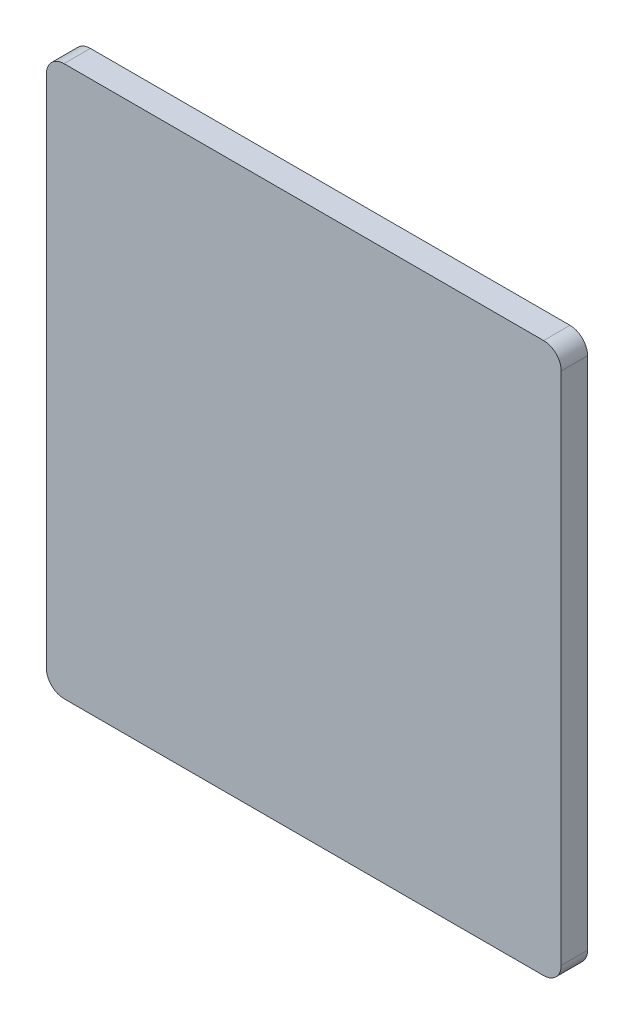
ISO-10303-21;
HEADER;
FILE_DESCRIPTION(('STEP AP214'),'2;1');
FILE_NAME('part.step','',(''),(''),'','','');
FILE_SCHEMA(('AUTOMOTIVE_DESIGN { 1 0 10303 214 1 1 1 1 }'));
ENDSEC;
DATA;
#1=APPLICATION_CONTEXT('core data for automotive mechanical design processes');
#2=APPLICATION_PROTOCOL_DEFINITION('international standard','automotive_design',2000,#1);
#3=PRODUCT_CONTEXT('',#1,'mechanical');
#4=PRODUCT('Part','Part','',(#3));
#5=PRODUCT_RELATED_PRODUCT_CATEGORY('part','',(#4));
#6=PRODUCT_DEFINITION_FORMATION('','',#4);
#7=PRODUCT_DEFINITION_CONTEXT('part definition',#1,'design');
#8=PRODUCT_DEFINITION('design','',#6,#7);
#9=PRODUCT_DEFINITION_SHAPE('','',#8);
#10=(LENGTH_UNIT() NAMED_UNIT(*) SI_UNIT(.MILLI.,.METRE.));
#11=(NAMED_UNIT(*) PLANE_ANGLE_UNIT() SI_UNIT($,.RADIAN.));
#12=(NAMED_UNIT(*) SI_UNIT($,.STERADIAN.) SOLID_ANGLE_UNIT());
#13=UNCERTAINTY_MEASURE_WITH_UNIT(LENGTH_MEASURE(1.E-05),#10,'distance_accuracy_value','');
#14=(GEOMETRIC_REPRESENTATION_CONTEXT(3) GLOBAL_UNCERTAINTY_ASSIGNED_CONTEXT((#13)) GLOBAL_UNIT_ASSIGNED_CONTEXT((#10,
#11,#12)) REPRESENTATION_CONTEXT('',''));
#15=CARTESIAN_POINT('',(0.,0.,0.));
#16=DIRECTION('',(0.,0.,1.));
#17=DIRECTION('',(1.,0.,0.));
#18=AXIS2_PLACEMENT_3D('',#15,#16,#17);
#19=CARTESIAN_POINT('',(2.,2.,3.));
#20=DIRECTION('',(0.,0.,-1.));
#21=DIRECTION('',(-1.,0.,0.));
#22=AXIS2_PLACEMENT_3D('',#19,#20,#21);
#23=CYLINDRICAL_SURFACE('',#22,2.);
#24=CARTESIAN_POINT('',(2.,2.,0.));
#25=DIRECTION('',(0.,0.,1.));
#26=DIRECTION('',(-1.,0.,0.));
#27=AXIS2_PLACEMENT_3D('',#24,#25,#26);
#28=CIRCLE('',#27,2.);
#29=CARTESIAN_POINT('',(0.,2.00000000000001,0.));
#30=VERTEX_POINT('',#29);
#31=CARTESIAN_POINT('',(2.00000000000001,0.,0.));
#32=VERTEX_POINT('',#31);
#33=EDGE_CURVE('E131',#30,#32,#28,.T.);
#34=ORIENTED_EDGE('',*,*,#33,.T.);
#35=DIRECTION('',(0.,0.,-1.));
#36=VECTOR('',#35,1.);
#37=CARTESIAN_POINT('',(2.00000000000001,0.,3.));
#38=LINE('',#37,#36);
#39=CARTESIAN_POINT('',(2.00000000000001,0.,3.));
#40=VERTEX_POINT('',#39);
#41=EDGE_CURVE('E11',#40,#32,#38,.T.);
#42=ORIENTED_EDGE('',*,*,#41,.F.);
#43=CARTESIAN_POINT('',(2.,2.,3.));
#44=DIRECTION('',(0.,0.,1.));
#45=DIRECTION('',(-1.,0.,0.));
#46=AXIS2_PLACEMENT_3D('',#43,#44,#45);
#47=CIRCLE('',#46,2.);
#48=CARTESIAN_POINT('',(0.,2.00000000000001,3.));
#49=VERTEX_POINT('',#48);
#50=EDGE_CURVE('E145',#49,#40,#47,.T.);
#51=ORIENTED_EDGE('',*,*,#50,.F.);
#52=DIRECTION('',(0.,0.,-1.));
#53=VECTOR('',#52,1.);
#54=CARTESIAN_POINT('',(0.,2.00000000000001,3.));
#55=LINE('',#54,#53);
#56=EDGE_CURVE('E127',#49,#30,#55,.T.);
#57=ORIENTED_EDGE('',*,*,#56,.T.);
#58=EDGE_LOOP('',(#34,#42,#51,#57));
#59=FACE_BOUND('',#58,.T.);
#60=ADVANCED_FACE('F35',(#59),#23,.T.);
#61=CARTESIAN_POINT('',(2.00000000000001,0.,3.));
#62=DIRECTION('',(0.,1.,0.));
#63=DIRECTION('',(0.,0.,1.));
#64=AXIS2_PLACEMENT_3D('',#61,#62,#63);
#65=PLANE('',#64);
#66=DIRECTION('',(1.,0.,0.));
#67=VECTOR('',#66,1.);
#68=CARTESIAN_POINT('',(2.00000000000001,0.,0.));
#69=LINE('',#68,#67);
#70=CARTESIAN_POINT('',(56.5,0.,0.));
#71=VERTEX_POINT('',#70);
#72=EDGE_CURVE('E134',#32,#71,#69,.T.);
#73=ORIENTED_EDGE('',*,*,#72,.T.);
#74=DIRECTION('',(0.,0.,-1.));
#75=VECTOR('',#74,1.);
#76=CARTESIAN_POINT('',(56.5,0.,3.));
#77=LINE('',#76,#75);
#78=CARTESIAN_POINT('',(56.5,0.,3.));
#79=VERTEX_POINT('',#78);
#80=EDGE_CURVE('E43',#79,#71,#77,.T.);
#81=ORIENTED_EDGE('',*,*,#80,.F.);
#82=DIRECTION('',(1.,0.,0.));
#83=VECTOR('',#82,1.);
#84=CARTESIAN_POINT('',(2.00000000000001,0.,3.));
#85=LINE('',#84,#83);
#86=EDGE_CURVE('E94',#40,#79,#85,.T.);
#87=ORIENTED_EDGE('',*,*,#86,.F.);
#88=ORIENTED_EDGE('',*,*,#41,.T.);
#89=EDGE_LOOP('',(#73,#81,#87,#88));
#90=FACE_BOUND('',#89,.T.);
#91=ADVANCED_FACE('F180',(#90),#65,.F.);
#92=CARTESIAN_POINT('',(56.5,2.,3.));
#93=DIRECTION('',(0.,0.,-1.));
#94=DIRECTION('',(-1.,0.,0.));
#95=AXIS2_PLACEMENT_3D('',#92,#93,#94);
#96=CYLINDRICAL_SURFACE('',#95,2.);
#97=CARTESIAN_POINT('',(56.5,2.,0.));
#98=DIRECTION('',(0.,0.,1.));
#99=DIRECTION('',(1.,0.,0.));
#100=AXIS2_PLACEMENT_3D('',#97,#98,#99);
#101=CIRCLE('',#100,2.);
#102=CARTESIAN_POINT('',(58.5,2.,0.));
#103=VERTEX_POINT('',#102);
#104=EDGE_CURVE('E136',#71,#103,#101,.T.);
#105=ORIENTED_EDGE('',*,*,#104,.T.);
#106=DIRECTION('',(0.,0.,-1.));
#107=VECTOR('',#106,1.);
#108=CARTESIAN_POINT('',(58.5,2.,3.));
#109=LINE('',#108,#107);
#110=CARTESIAN_POINT('',(58.5,2.,3.));
#111=VERTEX_POINT('',#110);
#112=EDGE_CURVE('E152',#111,#103,#109,.T.);
#113=ORIENTED_EDGE('',*,*,#112,.F.);
#114=CARTESIAN_POINT('',(56.5,2.,3.));
#115=DIRECTION('',(0.,0.,1.));
#116=DIRECTION('',(1.,0.,0.));
#117=AXIS2_PLACEMENT_3D('',#114,#115,#116);
#118=CIRCLE('',#117,2.);
#119=EDGE_CURVE('E160',#79,#111,#118,.T.);
#120=ORIENTED_EDGE('',*,*,#119,.F.);
#121=ORIENTED_EDGE('',*,*,#80,.T.);
#122=EDGE_LOOP('',(#105,#113,#120,#121));
#123=FACE_BOUND('',#122,.T.);
#124=ADVANCED_FACE('F158',(#123),#96,.T.);
#125=CARTESIAN_POINT('',(58.5,2.00000000000001,3.));
#126=DIRECTION('',(-1.,0.,0.));
#127=DIRECTION('',(0.,-1.,0.));
#128=AXIS2_PLACEMENT_3D('',#125,#126,#127);
#129=PLANE('',#128);
#130=DIRECTION('',(0.,1.,0.));
#131=VECTOR('',#130,1.);
#132=CARTESIAN_POINT('',(58.5,2.00000000000001,0.));
#133=LINE('',#132,#131);
#134=CARTESIAN_POINT('',(58.5,60.5,0.));
#135=VERTEX_POINT('',#134);
#136=EDGE_CURVE('E138',#103,#135,#133,.T.);
#137=ORIENTED_EDGE('',*,*,#136,.T.);
#138=DIRECTION('',(0.,0.,-1.));
#139=VECTOR('',#138,1.);
#140=CARTESIAN_POINT('',(58.5,60.5,3.));
#141=LINE('',#140,#139);
#142=CARTESIAN_POINT('',(58.5,60.5,3.));
#143=VERTEX_POINT('',#142);
#144=EDGE_CURVE('E149',#143,#135,#141,.T.);
#145=ORIENTED_EDGE('',*,*,#144,.F.);
#146=DIRECTION('',(0.,1.,0.));
#147=VECTOR('',#146,1.);
#148=CARTESIAN_POINT('',(58.5,2.00000000000001,3.));
#149=LINE('',#148,#147);
#150=EDGE_CURVE('E172',#111,#143,#149,.T.);
#151=ORIENTED_EDGE('',*,*,#150,.F.);
#152=ORIENTED_EDGE('',*,*,#112,.T.);
#153=EDGE_LOOP('',(#137,#145,#151,#152));
#154=FACE_BOUND('',#153,.T.);
#155=ADVANCED_FACE('F168',(#154),#129,.F.);
#156=CARTESIAN_POINT('',(56.5,60.5,3.));
#157=DIRECTION('',(0.,0.,-1.));
#158=DIRECTION('',(-1.,0.,0.));
#159=AXIS2_PLACEMENT_3D('',#156,#157,#158);
#160=CYLINDRICAL_SURFACE('',#159,2.);
#161=CARTESIAN_POINT('',(56.5,60.5,0.));
#162=DIRECTION('',(0.,0.,1.));
#163=DIRECTION('',(-1.,0.,0.));
#164=AXIS2_PLACEMENT_3D('',#161,#162,#163);
#165=CIRCLE('',#164,2.);
#166=CARTESIAN_POINT('',(56.5,62.5,0.));
#167=VERTEX_POINT('',#166);
#168=EDGE_CURVE('E140',#135,#167,#165,.T.);
#169=ORIENTED_EDGE('',*,*,#168,.T.);
#170=DIRECTION('',(0.,0.,-1.));
#171=VECTOR('',#170,1.);
#172=CARTESIAN_POINT('',(56.5,62.5,3.));
#173=LINE('',#172,#171);
#174=CARTESIAN_POINT('',(56.5,62.5,3.));
#175=VERTEX_POINT('',#174);
#176=EDGE_CURVE('E122',#175,#167,#173,.T.);
#177=ORIENTED_EDGE('',*,*,#176,.F.);
#178=CARTESIAN_POINT('',(56.5,60.5,3.));
#179=DIRECTION('',(0.,0.,1.));
#180=DIRECTION('',(-1.,0.,0.));
#181=AXIS2_PLACEMENT_3D('',#178,#179,#180);
#182=CIRCLE('',#181,2.);
#183=EDGE_CURVE('E113',#143,#175,#182,.T.);
#184=ORIENTED_EDGE('',*,*,#183,.F.);
#185=ORIENTED_EDGE('',*,*,#144,.T.);
#186=EDGE_LOOP('',(#169,#177,#184,#185));
#187=FACE_BOUND('',#186,.T.);
#188=ADVANCED_FACE('F171',(#187),#160,.T.);
#189=CARTESIAN_POINT('',(2.00000000000001,62.5,3.));
#190=DIRECTION('',(0.,-1.,0.));
#191=DIRECTION('',(0.,0.,-1.));
#192=AXIS2_PLACEMENT_3D('',#189,#190,#191);
#193=PLANE('',#192);
#194=DIRECTION('',(-1.,0.,0.));
#195=VECTOR('',#194,1.);
#196=CARTESIAN_POINT('',(2.00000000000001,62.5,0.));
#197=LINE('',#196,#195);
#198=CARTESIAN_POINT('',(2.00000000000001,62.5,0.));
#199=VERTEX_POINT('',#198);
#200=EDGE_CURVE('E121',#167,#199,#197,.T.);
#201=ORIENTED_EDGE('',*,*,#200,.T.);
#202=DIRECTION('',(0.,0.,-1.));
#203=VECTOR('',#202,1.);
#204=CARTESIAN_POINT('',(2.00000000000001,62.5,3.));
#205=LINE('',#204,#203);
#206=CARTESIAN_POINT('',(2.00000000000001,62.5,3.));
#207=VERTEX_POINT('',#206);
#208=EDGE_CURVE('E118',#207,#199,#205,.T.);
#209=ORIENTED_EDGE('',*,*,#208,.F.);
#210=DIRECTION('',(-1.,0.,0.));
#211=VECTOR('',#210,1.);
#212=CARTESIAN_POINT('',(2.00000000000001,62.5,3.));
#213=LINE('',#212,#211);
#214=EDGE_CURVE('E107',#175,#207,#213,.T.);
#215=ORIENTED_EDGE('',*,*,#214,.F.);
#216=ORIENTED_EDGE('',*,*,#176,.T.);
#217=EDGE_LOOP('',(#201,#209,#215,#216));
#218=FACE_BOUND('',#217,.T.);
#219=ADVANCED_FACE('F119',(#218),#193,.F.);
#220=CARTESIAN_POINT('',(1.99999999999999,60.5,3.));
#221=DIRECTION('',(0.,0.,-1.));
#222=DIRECTION('',(-1.,0.,0.));
#223=AXIS2_PLACEMENT_3D('',#220,#221,#222);
#224=CYLINDRICAL_SURFACE('',#223,2.);
#225=CARTESIAN_POINT('',(1.99999999999999,60.5,0.));
#226=DIRECTION('',(0.,0.,1.));
#227=DIRECTION('',(-1.,0.,0.));
#228=AXIS2_PLACEMENT_3D('',#225,#226,#227);
#229=CIRCLE('',#228,2.);
#230=CARTESIAN_POINT('',(0.,60.5,0.));
#231=VERTEX_POINT('',#230);
#232=EDGE_CURVE('E80',#199,#231,#229,.T.);
#233=ORIENTED_EDGE('',*,*,#232,.T.);
#234=DIRECTION('',(0.,0.,-1.));
#235=VECTOR('',#234,1.);
#236=CARTESIAN_POINT('',(0.,60.5,3.));
#237=LINE('',#236,#235);
#238=CARTESIAN_POINT('',(0.,60.5,3.));
#239=VERTEX_POINT('',#238);
#240=EDGE_CURVE('E123',#239,#231,#237,.T.);
#241=ORIENTED_EDGE('',*,*,#240,.F.);
#242=CARTESIAN_POINT('',(1.99999999999999,60.5,3.));
#243=DIRECTION('',(0.,0.,1.));
#244=DIRECTION('',(-1.,0.,0.));
#245=AXIS2_PLACEMENT_3D('',#242,#243,#244);
#246=CIRCLE('',#245,2.);
#247=EDGE_CURVE('E111',#207,#239,#246,.T.);
#248=ORIENTED_EDGE('',*,*,#247,.F.);
#249=ORIENTED_EDGE('',*,*,#208,.T.);
#250=EDGE_LOOP('',(#233,#241,#248,#249));
#251=FACE_BOUND('',#250,.T.);
#252=ADVANCED_FACE('F125',(#251),#224,.T.);
#253=CARTESIAN_POINT('',(0.,2.00000000000001,3.));
#254=DIRECTION('',(1.,0.,0.));
#255=DIRECTION('',(0.,1.,0.));
#256=AXIS2_PLACEMENT_3D('',#253,#254,#255);
#257=PLANE('',#256);
#258=DIRECTION('',(0.,-1.,0.));
#259=VECTOR('',#258,1.);
#260=CARTESIAN_POINT('',(0.,2.00000000000001,0.));
#261=LINE('',#260,#259);
#262=EDGE_CURVE('E86',#231,#30,#261,.T.);
#263=ORIENTED_EDGE('',*,*,#262,.T.);
#264=ORIENTED_EDGE('',*,*,#56,.F.);
#265=DIRECTION('',(0.,-1.,0.));
#266=VECTOR('',#265,1.);
#267=CARTESIAN_POINT('',(0.,2.00000000000001,3.));
#268=LINE('',#267,#266);
#269=EDGE_CURVE('E51',#239,#49,#268,.T.);
#270=ORIENTED_EDGE('',*,*,#269,.F.);
#271=ORIENTED_EDGE('',*,*,#240,.T.);
#272=EDGE_LOOP('',(#263,#264,#270,#271));
#273=FACE_BOUND('',#272,.T.);
#274=ADVANCED_FACE('F196',(#273),#257,.F.);
#275=CARTESIAN_POINT('',(2.,2.,3.));
#276=DIRECTION('',(0.,0.,-1.));
#277=DIRECTION('',(-1.,0.,0.));
#278=AXIS2_PLACEMENT_3D('',#275,#276,#277);
#279=PLANE('',#278);
#280=ORIENTED_EDGE('',*,*,#50,.T.);
#281=ORIENTED_EDGE('',*,*,#86,.T.);
#282=ORIENTED_EDGE('',*,*,#119,.T.);
#283=ORIENTED_EDGE('',*,*,#150,.T.);
#284=ORIENTED_EDGE('',*,*,#183,.T.);
#285=ORIENTED_EDGE('',*,*,#214,.T.);
#286=ORIENTED_EDGE('',*,*,#247,.T.);
#287=ORIENTED_EDGE('',*,*,#269,.T.);
#288=EDGE_LOOP('',(#280,#281,#282,#283,#284,#285,#286,#287));
#289=FACE_BOUND('',#288,.T.);
#290=ADVANCED_FACE('F109',(#289),#279,.F.);
#291=CARTESIAN_POINT('',(2.,2.,0.));
#292=DIRECTION('',(0.,0.,-1.));
#293=DIRECTION('',(-1.,0.,0.));
#294=AXIS2_PLACEMENT_3D('',#291,#292,#293);
#295=PLANE('',#294);
#296=ORIENTED_EDGE('',*,*,#33,.F.);
#297=ORIENTED_EDGE('',*,*,#262,.F.);
#298=ORIENTED_EDGE('',*,*,#232,.F.);
#299=ORIENTED_EDGE('',*,*,#200,.F.);
#300=ORIENTED_EDGE('',*,*,#168,.F.);
#301=ORIENTED_EDGE('',*,*,#136,.F.);
#302=ORIENTED_EDGE('',*,*,#104,.F.);
#303=ORIENTED_EDGE('',*,*,#72,.F.);
#304=EDGE_LOOP('',(#296,#297,#298,#299,#300,#301,#302,#303));
#305=FACE_BOUND('',#304,.T.);
#306=ADVANCED_FACE('F164',(#305),#295,.T.);
#307=CLOSED_SHELL('',(#60,#91,#124,#155,#188,#219,#252,#274,#290,#306));
#308=MANIFOLD_SOLID_BREP('B2',#307);
#309=ADVANCED_BREP_SHAPE_REPRESENTATION('',(#18,#308),#14);
#310=SHAPE_DEFINITION_REPRESENTATION(#9,#309);
ENDSEC;
END-ISO-10303-21;
